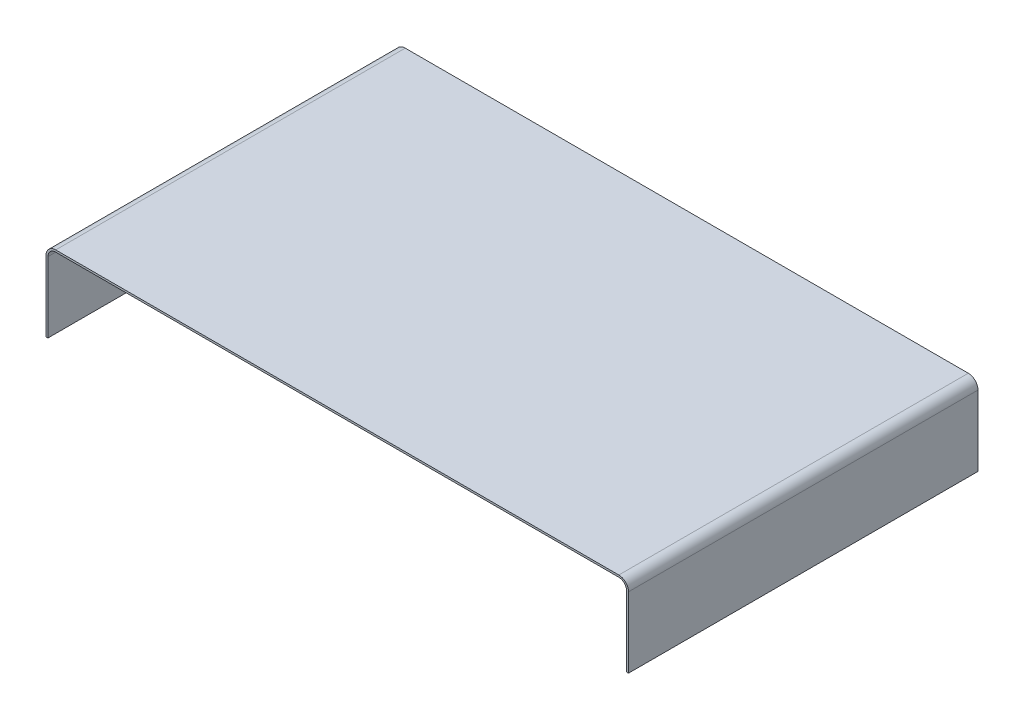
ISO-10303-21;
HEADER;
FILE_DESCRIPTION(('STEP AP214'),'2;1');
FILE_NAME('part.step','',(''),(''),'','','');
FILE_SCHEMA(('AUTOMOTIVE_DESIGN { 1 0 10303 214 1 1 1 1 }'));
ENDSEC;
DATA;
#1=APPLICATION_CONTEXT('core data for automotive mechanical design processes');
#2=APPLICATION_PROTOCOL_DEFINITION('international standard','automotive_design',2000,#1);
#3=PRODUCT_CONTEXT('',#1,'mechanical');
#4=PRODUCT('Part','Part','',(#3));
#5=PRODUCT_RELATED_PRODUCT_CATEGORY('part','',(#4));
#6=PRODUCT_DEFINITION_FORMATION('','',#4);
#7=PRODUCT_DEFINITION_CONTEXT('part definition',#1,'design');
#8=PRODUCT_DEFINITION('design','',#6,#7);
#9=PRODUCT_DEFINITION_SHAPE('','',#8);
#10=(LENGTH_UNIT() NAMED_UNIT(*) SI_UNIT(.MILLI.,.METRE.));
#11=(NAMED_UNIT(*) PLANE_ANGLE_UNIT() SI_UNIT($,.RADIAN.));
#12=(NAMED_UNIT(*) SI_UNIT($,.STERADIAN.) SOLID_ANGLE_UNIT());
#13=UNCERTAINTY_MEASURE_WITH_UNIT(LENGTH_MEASURE(1.E-05),#10,'distance_accuracy_value','');
#14=(GEOMETRIC_REPRESENTATION_CONTEXT(3) GLOBAL_UNCERTAINTY_ASSIGNED_CONTEXT((#13)) GLOBAL_UNIT_ASSIGNED_CONTEXT((#10,
#11,#12)) REPRESENTATION_CONTEXT('',''));
#15=CARTESIAN_POINT('',(0.,0.,0.));
#16=DIRECTION('',(0.,0.,1.));
#17=DIRECTION('',(1.,0.,0.));
#18=AXIS2_PLACEMENT_3D('',#15,#16,#17);
#19=CARTESIAN_POINT('',(0.,0.,180.));
#20=DIRECTION('',(0.,1.,0.));
#21=DIRECTION('',(0.,0.,1.));
#22=AXIS2_PLACEMENT_3D('',#19,#20,#21);
#23=PLANE('',#22);
#24=DIRECTION('',(1.,0.,0.));
#25=VECTOR('',#24,1.);
#26=CARTESIAN_POINT('',(0.,0.,0.));
#27=LINE('',#26,#25);
#28=CARTESIAN_POINT('',(0.,0.,0.));
#29=VERTEX_POINT('',#28);
#30=CARTESIAN_POINT('',(1.,0.,0.));
#31=VERTEX_POINT('',#30);
#32=EDGE_CURVE('E153',#29,#31,#27,.T.);
#33=ORIENTED_EDGE('',*,*,#32,.T.);
#34=DIRECTION('',(0.,0.,-1.));
#35=VECTOR('',#34,1.);
#36=CARTESIAN_POINT('',(1.,0.,180.));
#37=LINE('',#36,#35);
#38=CARTESIAN_POINT('',(1.,0.,180.));
#39=VERTEX_POINT('',#38);
#40=EDGE_CURVE('E11',#39,#31,#37,.T.);
#41=ORIENTED_EDGE('',*,*,#40,.F.);
#42=DIRECTION('',(1.,0.,0.));
#43=VECTOR('',#42,1.);
#44=CARTESIAN_POINT('',(0.,0.,180.));
#45=LINE('',#44,#43);
#46=CARTESIAN_POINT('',(0.,0.,180.));
#47=VERTEX_POINT('',#46);
#48=EDGE_CURVE('E175',#47,#39,#45,.T.);
#49=ORIENTED_EDGE('',*,*,#48,.F.);
#50=DIRECTION('',(0.,0.,-1.));
#51=VECTOR('',#50,1.);
#52=CARTESIAN_POINT('',(0.,0.,180.));
#53=LINE('',#52,#51);
#54=EDGE_CURVE('E149',#47,#29,#53,.T.);
#55=ORIENTED_EDGE('',*,*,#54,.T.);
#56=EDGE_LOOP('',(#33,#41,#49,#55));
#57=FACE_BOUND('',#56,.T.);
#58=ADVANCED_FACE('F33',(#57),#23,.F.);
#59=CARTESIAN_POINT('',(1.,0.,180.));
#60=DIRECTION('',(-1.,0.,0.));
#61=DIRECTION('',(0.,0.,1.));
#62=AXIS2_PLACEMENT_3D('',#59,#60,#61);
#63=PLANE('',#62);
#64=DIRECTION('',(0.,1.,0.));
#65=VECTOR('',#64,1.);
#66=CARTESIAN_POINT('',(1.,0.,0.));
#67=LINE('',#66,#65);
#68=CARTESIAN_POINT('',(1.,36.3,0.));
#69=VERTEX_POINT('',#68);
#70=EDGE_CURVE('E156',#31,#69,#67,.T.);
#71=ORIENTED_EDGE('',*,*,#70,.T.);
#72=DIRECTION('',(0.,0.,-1.));
#73=VECTOR('',#72,1.);
#74=CARTESIAN_POINT('',(1.,36.3,180.));
#75=LINE('',#74,#73);
#76=CARTESIAN_POINT('',(1.,36.3,180.));
#77=VERTEX_POINT('',#76);
#78=EDGE_CURVE('E41',#77,#69,#75,.T.);
#79=ORIENTED_EDGE('',*,*,#78,.F.);
#80=DIRECTION('',(0.,1.,0.));
#81=VECTOR('',#80,1.);
#82=CARTESIAN_POINT('',(1.,0.,180.));
#83=LINE('',#82,#81);
#84=EDGE_CURVE('E104',#39,#77,#83,.T.);
#85=ORIENTED_EDGE('',*,*,#84,.F.);
#86=ORIENTED_EDGE('',*,*,#40,.T.);
#87=EDGE_LOOP('',(#71,#79,#85,#86));
#88=FACE_BOUND('',#87,.T.);
#89=ADVANCED_FACE('F253',(#88),#63,.F.);
#90=CARTESIAN_POINT('',(5.,36.3,180.));
#91=DIRECTION('',(0.,0.,-1.));
#92=DIRECTION('',(-1.,0.,0.));
#93=AXIS2_PLACEMENT_3D('',#90,#91,#92);
#94=CYLINDRICAL_SURFACE('',#93,4.);
#95=CARTESIAN_POINT('',(5.,36.3,0.));
#96=DIRECTION('',(0.,0.,-1.));
#97=DIRECTION('',(-1.,0.,0.));
#98=AXIS2_PLACEMENT_3D('',#95,#96,#97);
#99=CIRCLE('',#98,4.);
#100=CARTESIAN_POINT('',(5.00000000000003,40.3,0.));
#101=VERTEX_POINT('',#100);
#102=EDGE_CURVE('E158',#69,#101,#99,.T.);
#103=ORIENTED_EDGE('',*,*,#102,.T.);
#104=DIRECTION('',(0.,0.,-1.));
#105=VECTOR('',#104,1.);
#106=CARTESIAN_POINT('',(5.00000000000003,40.3,180.));
#107=LINE('',#106,#105);
#108=CARTESIAN_POINT('',(5.00000000000003,40.3,180.));
#109=VERTEX_POINT('',#108);
#110=EDGE_CURVE('E194',#109,#101,#107,.T.);
#111=ORIENTED_EDGE('',*,*,#110,.F.);
#112=CARTESIAN_POINT('',(5.,36.3,180.));
#113=DIRECTION('',(0.,0.,-1.));
#114=DIRECTION('',(-1.,0.,0.));
#115=AXIS2_PLACEMENT_3D('',#112,#113,#114);
#116=CIRCLE('',#115,4.);
#117=EDGE_CURVE('E202',#77,#109,#116,.T.);
#118=ORIENTED_EDGE('',*,*,#117,.F.);
#119=ORIENTED_EDGE('',*,*,#78,.T.);
#120=EDGE_LOOP('',(#103,#111,#118,#119));
#121=FACE_BOUND('',#120,.T.);
#122=ADVANCED_FACE('F200',(#121),#94,.F.);
#123=CARTESIAN_POINT('',(5.00000000000003,40.3,180.));
#124=DIRECTION('',(0.,1.,0.));
#125=DIRECTION('',(0.,0.,1.));
#126=AXIS2_PLACEMENT_3D('',#123,#124,#125);
#127=PLANE('',#126);
#128=DIRECTION('',(1.,0.,0.));
#129=VECTOR('',#128,1.);
#130=CARTESIAN_POINT('',(5.00000000000003,40.3,0.));
#131=LINE('',#130,#129);
#132=CARTESIAN_POINT('',(295.,40.3,0.));
#133=VERTEX_POINT('',#132);
#134=EDGE_CURVE('E160',#101,#133,#131,.T.);
#135=ORIENTED_EDGE('',*,*,#134,.T.);
#136=DIRECTION('',(0.,0.,-1.));
#137=VECTOR('',#136,1.);
#138=CARTESIAN_POINT('',(295.,40.3,180.));
#139=LINE('',#138,#137);
#140=CARTESIAN_POINT('',(295.,40.3,180.));
#141=VERTEX_POINT('',#140);
#142=EDGE_CURVE('E191',#141,#133,#139,.T.);
#143=ORIENTED_EDGE('',*,*,#142,.F.);
#144=DIRECTION('',(1.,0.,0.));
#145=VECTOR('',#144,1.);
#146=CARTESIAN_POINT('',(5.00000000000003,40.3,180.));
#147=LINE('',#146,#145);
#148=EDGE_CURVE('E220',#109,#141,#147,.T.);
#149=ORIENTED_EDGE('',*,*,#148,.F.);
#150=ORIENTED_EDGE('',*,*,#110,.T.);
#151=EDGE_LOOP('',(#135,#143,#149,#150));
#152=FACE_BOUND('',#151,.T.);
#153=ADVANCED_FACE('F211',(#152),#127,.F.);
#154=CARTESIAN_POINT('',(295.,36.3,180.));
#155=DIRECTION('',(0.,0.,-1.));
#156=DIRECTION('',(-1.,0.,0.));
#157=AXIS2_PLACEMENT_3D('',#154,#155,#156);
#158=CYLINDRICAL_SURFACE('',#157,4.);
#159=CARTESIAN_POINT('',(295.,36.3,0.));
#160=DIRECTION('',(0.,0.,-1.));
#161=DIRECTION('',(1.,0.,0.));
#162=AXIS2_PLACEMENT_3D('',#159,#160,#161);
#163=CIRCLE('',#162,4.);
#164=CARTESIAN_POINT('',(299.,36.3,0.));
#165=VERTEX_POINT('',#164);
#166=EDGE_CURVE('E162',#133,#165,#163,.T.);
#167=ORIENTED_EDGE('',*,*,#166,.T.);
#168=DIRECTION('',(0.,0.,-1.));
#169=VECTOR('',#168,1.);
#170=CARTESIAN_POINT('',(299.,36.3,180.));
#171=LINE('',#170,#169);
#172=CARTESIAN_POINT('',(299.,36.3,180.));
#173=VERTEX_POINT('',#172);
#174=EDGE_CURVE('E188',#173,#165,#171,.T.);
#175=ORIENTED_EDGE('',*,*,#174,.F.);
#176=CARTESIAN_POINT('',(295.,36.3,180.));
#177=DIRECTION('',(0.,0.,-1.));
#178=DIRECTION('',(1.,0.,0.));
#179=AXIS2_PLACEMENT_3D('',#176,#177,#178);
#180=CIRCLE('',#179,4.);
#181=EDGE_CURVE('E217',#141,#173,#180,.T.);
#182=ORIENTED_EDGE('',*,*,#181,.F.);
#183=ORIENTED_EDGE('',*,*,#142,.T.);
#184=EDGE_LOOP('',(#167,#175,#182,#183));
#185=FACE_BOUND('',#184,.T.);
#186=ADVANCED_FACE('F215',(#185),#158,.F.);
#187=CARTESIAN_POINT('',(299.,0.,180.));
#188=DIRECTION('',(1.,0.,0.));
#189=DIRECTION('',(0.,0.,-1.));
#190=AXIS2_PLACEMENT_3D('',#187,#188,#189);
#191=PLANE('',#190);
#192=DIRECTION('',(0.,-1.,0.));
#193=VECTOR('',#192,1.);
#194=CARTESIAN_POINT('',(299.,0.,0.));
#195=LINE('',#194,#193);
#196=CARTESIAN_POINT('',(299.,0.,0.));
#197=VERTEX_POINT('',#196);
#198=EDGE_CURVE('E164',#165,#197,#195,.T.);
#199=ORIENTED_EDGE('',*,*,#198,.T.);
#200=DIRECTION('',(0.,0.,-1.));
#201=VECTOR('',#200,1.);
#202=CARTESIAN_POINT('',(299.,0.,180.));
#203=LINE('',#202,#201);
#204=CARTESIAN_POINT('',(299.,0.,180.));
#205=VERTEX_POINT('',#204);
#206=EDGE_CURVE('E185',#205,#197,#203,.T.);
#207=ORIENTED_EDGE('',*,*,#206,.F.);
#208=DIRECTION('',(0.,-1.,0.));
#209=VECTOR('',#208,1.);
#210=CARTESIAN_POINT('',(299.,0.,180.));
#211=LINE('',#210,#209);
#212=EDGE_CURVE('E219',#173,#205,#211,.T.);
#213=ORIENTED_EDGE('',*,*,#212,.F.);
#214=ORIENTED_EDGE('',*,*,#174,.T.);
#215=EDGE_LOOP('',(#199,#207,#213,#214));
#216=FACE_BOUND('',#215,.T.);
#217=ADVANCED_FACE('F266',(#216),#191,.F.);
#218=CARTESIAN_POINT('',(299.,0.,180.));
#219=DIRECTION('',(0.,1.,0.));
#220=DIRECTION('',(0.,0.,1.));
#221=AXIS2_PLACEMENT_3D('',#218,#219,#220);
#222=PLANE('',#221);
#223=DIRECTION('',(1.,0.,0.));
#224=VECTOR('',#223,1.);
#225=CARTESIAN_POINT('',(299.,0.,0.));
#226=LINE('',#225,#224);
#227=CARTESIAN_POINT('',(300.,0.,0.));
#228=VERTEX_POINT('',#227);
#229=EDGE_CURVE('E166',#197,#228,#226,.T.);
#230=ORIENTED_EDGE('',*,*,#229,.T.);
#231=DIRECTION('',(0.,0.,-1.));
#232=VECTOR('',#231,1.);
#233=CARTESIAN_POINT('',(300.,0.,180.));
#234=LINE('',#233,#232);
#235=CARTESIAN_POINT('',(300.,0.,180.));
#236=VERTEX_POINT('',#235);
#237=EDGE_CURVE('E182',#236,#228,#234,.T.);
#238=ORIENTED_EDGE('',*,*,#237,.F.);
#239=DIRECTION('',(1.,0.,0.));
#240=VECTOR('',#239,1.);
#241=CARTESIAN_POINT('',(299.,0.,180.));
#242=LINE('',#241,#240);
#243=EDGE_CURVE('E222',#205,#236,#242,.T.);
#244=ORIENTED_EDGE('',*,*,#243,.F.);
#245=ORIENTED_EDGE('',*,*,#206,.T.);
#246=EDGE_LOOP('',(#230,#238,#244,#245));
#247=FACE_BOUND('',#246,.T.);
#248=ADVANCED_FACE('F269',(#247),#222,.F.);
#249=CARTESIAN_POINT('',(300.,0.,180.));
#250=DIRECTION('',(-1.,0.,0.));
#251=DIRECTION('',(0.,0.,1.));
#252=AXIS2_PLACEMENT_3D('',#249,#250,#251);
#253=PLANE('',#252);
#254=DIRECTION('',(0.,1.,0.));
#255=VECTOR('',#254,1.);
#256=CARTESIAN_POINT('',(300.,0.,0.));
#257=LINE('',#256,#255);
#258=CARTESIAN_POINT('',(300.,36.3,0.));
#259=VERTEX_POINT('',#258);
#260=EDGE_CURVE('E168',#228,#259,#257,.T.);
#261=ORIENTED_EDGE('',*,*,#260,.T.);
#262=DIRECTION('',(0.,0.,-1.));
#263=VECTOR('',#262,1.);
#264=CARTESIAN_POINT('',(300.,36.3,180.));
#265=LINE('',#264,#263);
#266=CARTESIAN_POINT('',(300.,36.3,180.));
#267=VERTEX_POINT('',#266);
#268=EDGE_CURVE('E179',#267,#259,#265,.T.);
#269=ORIENTED_EDGE('',*,*,#268,.F.);
#270=DIRECTION('',(0.,1.,0.));
#271=VECTOR('',#270,1.);
#272=CARTESIAN_POINT('',(300.,0.,180.));
#273=LINE('',#272,#271);
#274=EDGE_CURVE('E228',#236,#267,#273,.T.);
#275=ORIENTED_EDGE('',*,*,#274,.F.);
#276=ORIENTED_EDGE('',*,*,#237,.T.);
#277=EDGE_LOOP('',(#261,#269,#275,#276));
#278=FACE_BOUND('',#277,.T.);
#279=ADVANCED_FACE('F234',(#278),#253,.F.);
#280=CARTESIAN_POINT('',(295.,36.3,180.));
#281=DIRECTION('',(0.,0.,-1.));
#282=DIRECTION('',(-1.,0.,0.));
#283=AXIS2_PLACEMENT_3D('',#280,#281,#282);
#284=CYLINDRICAL_SURFACE('',#283,4.99999999999997);
#285=CARTESIAN_POINT('',(295.,36.3,0.));
#286=DIRECTION('',(0.,0.,1.));
#287=DIRECTION('',(1.,0.,0.));
#288=AXIS2_PLACEMENT_3D('',#285,#286,#287);
#289=CIRCLE('',#288,4.99999999999997);
#290=CARTESIAN_POINT('',(295.,41.3,0.));
#291=VERTEX_POINT('',#290);
#292=EDGE_CURVE('E170',#259,#291,#289,.T.);
#293=ORIENTED_EDGE('',*,*,#292,.T.);
#294=DIRECTION('',(0.,0.,-1.));
#295=VECTOR('',#294,1.);
#296=CARTESIAN_POINT('',(295.,41.3,180.));
#297=LINE('',#296,#295);
#298=CARTESIAN_POINT('',(295.,41.3,180.));
#299=VERTEX_POINT('',#298);
#300=EDGE_CURVE('E144',#299,#291,#297,.T.);
#301=ORIENTED_EDGE('',*,*,#300,.F.);
#302=CARTESIAN_POINT('',(295.,36.3,180.));
#303=DIRECTION('',(0.,0.,1.));
#304=DIRECTION('',(1.,0.,0.));
#305=AXIS2_PLACEMENT_3D('',#302,#303,#304);
#306=CIRCLE('',#305,4.99999999999997);
#307=EDGE_CURVE('E135',#267,#299,#306,.T.);
#308=ORIENTED_EDGE('',*,*,#307,.F.);
#309=ORIENTED_EDGE('',*,*,#268,.T.);
#310=EDGE_LOOP('',(#293,#301,#308,#309));
#311=FACE_BOUND('',#310,.T.);
#312=ADVANCED_FACE('F238',(#311),#284,.T.);
#313=CARTESIAN_POINT('',(5.00000000000004,41.3,180.));
#314=DIRECTION('',(0.,-1.,0.));
#315=DIRECTION('',(0.,0.,-1.));
#316=AXIS2_PLACEMENT_3D('',#313,#314,#315);
#317=PLANE('',#316);
#318=DIRECTION('',(-1.,0.,0.));
#319=VECTOR('',#318,1.);
#320=CARTESIAN_POINT('',(5.00000000000004,41.3,0.));
#321=LINE('',#320,#319);
#322=CARTESIAN_POINT('',(5.00000000000004,41.3,0.));
#323=VERTEX_POINT('',#322);
#324=EDGE_CURVE('E143',#291,#323,#321,.T.);
#325=ORIENTED_EDGE('',*,*,#324,.T.);
#326=DIRECTION('',(0.,0.,-1.));
#327=VECTOR('',#326,1.);
#328=CARTESIAN_POINT('',(5.00000000000004,41.3,180.));
#329=LINE('',#328,#327);
#330=CARTESIAN_POINT('',(5.00000000000004,41.3,180.));
#331=VERTEX_POINT('',#330);
#332=EDGE_CURVE('E140',#331,#323,#329,.T.);
#333=ORIENTED_EDGE('',*,*,#332,.F.);
#334=DIRECTION('',(-1.,0.,0.));
#335=VECTOR('',#334,1.);
#336=CARTESIAN_POINT('',(5.00000000000004,41.3,180.));
#337=LINE('',#336,#335);
#338=EDGE_CURVE('E129',#299,#331,#337,.T.);
#339=ORIENTED_EDGE('',*,*,#338,.F.);
#340=ORIENTED_EDGE('',*,*,#300,.T.);
#341=EDGE_LOOP('',(#325,#333,#339,#340));
#342=FACE_BOUND('',#341,.T.);
#343=ADVANCED_FACE('F141',(#342),#317,.F.);
#344=CARTESIAN_POINT('',(5.,36.3,180.));
#345=DIRECTION('',(0.,0.,-1.));
#346=DIRECTION('',(-1.,0.,0.));
#347=AXIS2_PLACEMENT_3D('',#344,#345,#346);
#348=CYLINDRICAL_SURFACE('',#347,5.);
#349=CARTESIAN_POINT('',(5.,36.3,0.));
#350=DIRECTION('',(0.,0.,1.));
#351=DIRECTION('',(-1.,0.,0.));
#352=AXIS2_PLACEMENT_3D('',#349,#350,#351);
#353=CIRCLE('',#352,5.);
#354=CARTESIAN_POINT('',(0.,36.3,0.));
#355=VERTEX_POINT('',#354);
#356=EDGE_CURVE('E90',#323,#355,#353,.T.);
#357=ORIENTED_EDGE('',*,*,#356,.T.);
#358=DIRECTION('',(0.,0.,-1.));
#359=VECTOR('',#358,1.);
#360=CARTESIAN_POINT('',(0.,36.3,180.));
#361=LINE('',#360,#359);
#362=CARTESIAN_POINT('',(0.,36.3,180.));
#363=VERTEX_POINT('',#362);
#364=EDGE_CURVE('E145',#363,#355,#361,.T.);
#365=ORIENTED_EDGE('',*,*,#364,.F.);
#366=CARTESIAN_POINT('',(5.,36.3,180.));
#367=DIRECTION('',(0.,0.,1.));
#368=DIRECTION('',(-1.,0.,0.));
#369=AXIS2_PLACEMENT_3D('',#366,#367,#368);
#370=CIRCLE('',#369,5.);
#371=EDGE_CURVE('E133',#331,#363,#370,.T.);
#372=ORIENTED_EDGE('',*,*,#371,.F.);
#373=ORIENTED_EDGE('',*,*,#332,.T.);
#374=EDGE_LOOP('',(#357,#365,#372,#373));
#375=FACE_BOUND('',#374,.T.);
#376=ADVANCED_FACE('F147',(#375),#348,.T.);
#377=CARTESIAN_POINT('',(0.,0.,180.));
#378=DIRECTION('',(1.,0.,0.));
#379=DIRECTION('',(0.,0.,-1.));
#380=AXIS2_PLACEMENT_3D('',#377,#378,#379);
#381=PLANE('',#380);
#382=DIRECTION('',(0.,-1.,0.));
#383=VECTOR('',#382,1.);
#384=CARTESIAN_POINT('',(0.,0.,0.));
#385=LINE('',#384,#383);
#386=EDGE_CURVE('E96',#355,#29,#385,.T.);
#387=ORIENTED_EDGE('',*,*,#386,.T.);
#388=ORIENTED_EDGE('',*,*,#54,.F.);
#389=DIRECTION('',(0.,-1.,0.));
#390=VECTOR('',#389,1.);
#391=CARTESIAN_POINT('',(0.,0.,180.));
#392=LINE('',#391,#390);
#393=EDGE_CURVE('E49',#363,#47,#392,.T.);
#394=ORIENTED_EDGE('',*,*,#393,.F.);
#395=ORIENTED_EDGE('',*,*,#364,.T.);
#396=EDGE_LOOP('',(#387,#388,#394,#395));
#397=FACE_BOUND('',#396,.T.);
#398=ADVANCED_FACE('F242',(#397),#381,.F.);
#399=CARTESIAN_POINT('',(5.,36.3,180.));
#400=DIRECTION('',(0.,0.,-1.));
#401=DIRECTION('',(-1.,0.,0.));
#402=AXIS2_PLACEMENT_3D('',#399,#400,#401);
#403=PLANE('',#402);
#404=ORIENTED_EDGE('',*,*,#48,.T.);
#405=ORIENTED_EDGE('',*,*,#84,.T.);
#406=ORIENTED_EDGE('',*,*,#117,.T.);
#407=ORIENTED_EDGE('',*,*,#148,.T.);
#408=ORIENTED_EDGE('',*,*,#181,.T.);
#409=ORIENTED_EDGE('',*,*,#212,.T.);
#410=ORIENTED_EDGE('',*,*,#243,.T.);
#411=ORIENTED_EDGE('',*,*,#274,.T.);
#412=ORIENTED_EDGE('',*,*,#307,.T.);
#413=ORIENTED_EDGE('',*,*,#338,.T.);
#414=ORIENTED_EDGE('',*,*,#371,.T.);
#415=ORIENTED_EDGE('',*,*,#393,.T.);
#416=EDGE_LOOP('',(#404,#405,#406,#407,#408,#409,#410,#411,#412,#413,#414,#415));
#417=FACE_BOUND('',#416,.T.);
#418=ADVANCED_FACE('F131',(#417),#403,.F.);
#419=CARTESIAN_POINT('',(5.,36.3,0.));
#420=DIRECTION('',(0.,0.,-1.));
#421=DIRECTION('',(-1.,0.,0.));
#422=AXIS2_PLACEMENT_3D('',#419,#420,#421);
#423=PLANE('',#422);
#424=ORIENTED_EDGE('',*,*,#32,.F.);
#425=ORIENTED_EDGE('',*,*,#386,.F.);
#426=ORIENTED_EDGE('',*,*,#356,.F.);
#427=ORIENTED_EDGE('',*,*,#324,.F.);
#428=ORIENTED_EDGE('',*,*,#292,.F.);
#429=ORIENTED_EDGE('',*,*,#260,.F.);
#430=ORIENTED_EDGE('',*,*,#229,.F.);
#431=ORIENTED_EDGE('',*,*,#198,.F.);
#432=ORIENTED_EDGE('',*,*,#166,.F.);
#433=ORIENTED_EDGE('',*,*,#134,.F.);
#434=ORIENTED_EDGE('',*,*,#102,.F.);
#435=ORIENTED_EDGE('',*,*,#70,.F.);
#436=EDGE_LOOP('',(#424,#425,#426,#427,#428,#429,#430,#431,#432,#433,#434,#435));
#437=FACE_BOUND('',#436,.T.);
#438=ADVANCED_FACE('F206',(#437),#423,.T.);
#439=CLOSED_SHELL('',(#58,#89,#122,#153,#186,#217,#248,#279,#312,#343,#376,#398,#418,#438));
#440=MANIFOLD_SOLID_BREP('B2',#439);
#441=ADVANCED_BREP_SHAPE_REPRESENTATION('',(#18,#440),#14);
#442=SHAPE_DEFINITION_REPRESENTATION(#9,#441);
ENDSEC;
END-ISO-10303-21;
